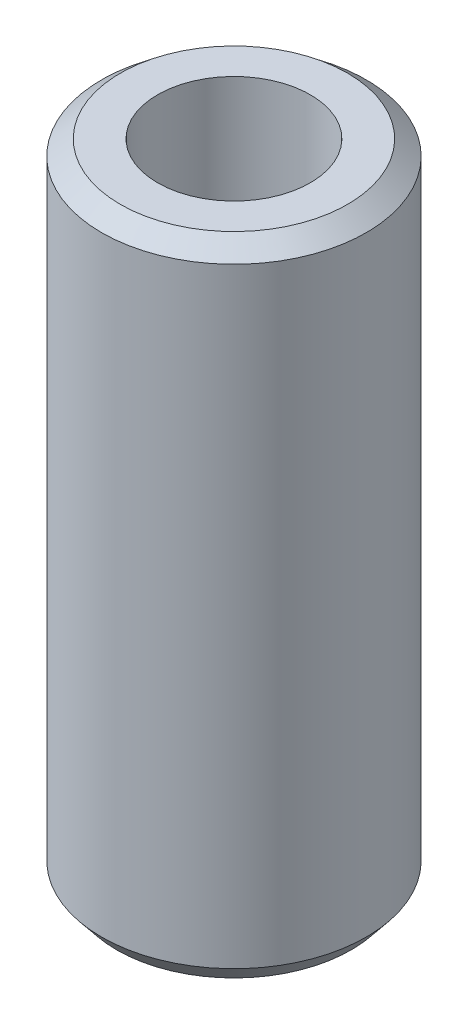
ISO-10303-21;
HEADER;
FILE_DESCRIPTION(('STEP AP214'),'2;1');
FILE_NAME('part.step','',(''),(''),'','','');
FILE_SCHEMA(('AUTOMOTIVE_DESIGN { 1 0 10303 214 1 1 1 1 }'));
ENDSEC;
DATA;
#1=APPLICATION_CONTEXT('core data for automotive mechanical design processes');
#2=APPLICATION_PROTOCOL_DEFINITION('international standard','automotive_design',2000,#1);
#3=PRODUCT_CONTEXT('',#1,'mechanical');
#4=PRODUCT('Part','Part','',(#3));
#5=PRODUCT_RELATED_PRODUCT_CATEGORY('part','',(#4));
#6=PRODUCT_DEFINITION_FORMATION('','',#4);
#7=PRODUCT_DEFINITION_CONTEXT('part definition',#1,'design');
#8=PRODUCT_DEFINITION('design','',#6,#7);
#9=PRODUCT_DEFINITION_SHAPE('','',#8);
#10=(LENGTH_UNIT() NAMED_UNIT(*) SI_UNIT(.MILLI.,.METRE.));
#11=(NAMED_UNIT(*) PLANE_ANGLE_UNIT() SI_UNIT($,.RADIAN.));
#12=(NAMED_UNIT(*) SI_UNIT($,.STERADIAN.) SOLID_ANGLE_UNIT());
#13=UNCERTAINTY_MEASURE_WITH_UNIT(LENGTH_MEASURE(1.E-05),#10,'distance_accuracy_value','');
#14=(GEOMETRIC_REPRESENTATION_CONTEXT(3) GLOBAL_UNCERTAINTY_ASSIGNED_CONTEXT((#13)) GLOBAL_UNIT_ASSIGNED_CONTEXT((#10,
#11,#12)) REPRESENTATION_CONTEXT('',''));
#15=CARTESIAN_POINT('',(0.,0.,0.));
#16=DIRECTION('',(0.,0.,1.));
#17=DIRECTION('',(1.,0.,0.));
#18=AXIS2_PLACEMENT_3D('',#15,#16,#17);
#19=CARTESIAN_POINT('',(0.,231.038125928066,0.));
#20=DIRECTION('',(0.,-1.,0.));
#21=DIRECTION('',(0.,0.,-1.));
#22=AXIS2_PLACEMENT_3D('',#19,#20,#21);
#23=CYLINDRICAL_SURFACE('',#22,47.5);
#24=CARTESIAN_POINT('',(0.,225.615658738167,0.));
#25=DIRECTION('',(0.,1.,0.));
#26=DIRECTION('',(0.,0.,1.));
#27=AXIS2_PLACEMENT_3D('',#24,#25,#26);
#28=CIRCLE('',#27,47.5);
#29=CARTESIAN_POINT('',(0.,225.615658738167,47.5));
#30=VERTEX_POINT('',#29);
#31=EDGE_CURVE('E50',#30,#30,#28,.F.);
#32=ORIENTED_EDGE('',*,*,#31,.T.);
#33=EDGE_LOOP('',(#32));
#34=FACE_BOUND('',#33,.T.);
#35=CARTESIAN_POINT('',(0.,6.71859885279838,0.));
#36=DIRECTION('',(0.,1.,0.));
#37=DIRECTION('',(0.,0.,1.));
#38=AXIS2_PLACEMENT_3D('',#35,#36,#37);
#39=CIRCLE('',#38,47.5);
#40=CARTESIAN_POINT('',(0.,6.71859885279838,47.5));
#41=VERTEX_POINT('',#40);
#42=EDGE_CURVE('E51',#41,#41,#39,.T.);
#43=ORIENTED_EDGE('',*,*,#42,.T.);
#44=EDGE_LOOP('',(#43));
#45=FACE_BOUND('',#44,.T.);
#46=ADVANCED_FACE('F39',(#34,#45),#23,.T.);
#47=CARTESIAN_POINT('',(0.,231.038125928066,0.));
#48=DIRECTION('',(0.,1.,0.));
#49=DIRECTION('',(0.,0.,1.));
#50=AXIS2_PLACEMENT_3D('',#47,#48,#49);
#51=PLANE('',#50);
#52=CARTESIAN_POINT('',(0.,231.038125928066,0.));
#53=DIRECTION('',(0.,1.,0.));
#54=DIRECTION('',(0.,0.,1.));
#55=AXIS2_PLACEMENT_3D('',#52,#53,#54);
#56=CIRCLE('',#55,40.7814011472015);
#57=CARTESIAN_POINT('',(0.,231.038125928066,40.7814011472015));
#58=VERTEX_POINT('',#57);
#59=EDGE_CURVE('E54',#58,#58,#56,.T.);
#60=ORIENTED_EDGE('',*,*,#59,.T.);
#61=EDGE_LOOP('',(#60));
#62=FACE_BOUND('',#61,.T.);
#63=CARTESIAN_POINT('',(0.,231.038125928066,0.));
#64=DIRECTION('',(0.,1.,0.));
#65=DIRECTION('',(0.,0.,1.));
#66=AXIS2_PLACEMENT_3D('',#63,#64,#65);
#67=CIRCLE('',#66,27.3940594900364);
#68=CARTESIAN_POINT('',(0.,231.038125928066,27.3940594900364));
#69=VERTEX_POINT('',#68);
#70=EDGE_CURVE('E58',#69,#69,#67,.T.);
#71=ORIENTED_EDGE('',*,*,#70,.F.);
#72=EDGE_LOOP('',(#71));
#73=FACE_BOUND('',#72,.T.);
#74=ADVANCED_FACE('F69',(#62,#73),#51,.T.);
#75=CARTESIAN_POINT('',(0.,0.,0.));
#76=DIRECTION('',(0.,1.,0.));
#77=DIRECTION('',(0.,0.,1.));
#78=AXIS2_PLACEMENT_3D('',#75,#76,#77);
#79=PLANE('',#78);
#80=CARTESIAN_POINT('',(0.,0.,0.));
#81=DIRECTION('',(0.,1.,0.));
#82=DIRECTION('',(0.,0.,1.));
#83=AXIS2_PLACEMENT_3D('',#80,#81,#82);
#84=CIRCLE('',#83,42.0775328101006);
#85=CARTESIAN_POINT('',(0.,0.,42.0775328101006));
#86=VERTEX_POINT('',#85);
#87=EDGE_CURVE('E10',#86,#86,#84,.F.);
#88=ORIENTED_EDGE('',*,*,#87,.T.);
#89=EDGE_LOOP('',(#88));
#90=FACE_BOUND('',#89,.T.);
#91=CARTESIAN_POINT('',(0.,0.,0.));
#92=DIRECTION('',(0.,1.,0.));
#93=DIRECTION('',(0.,0.,1.));
#94=AXIS2_PLACEMENT_3D('',#91,#92,#93);
#95=CIRCLE('',#94,27.3940594900364);
#96=CARTESIAN_POINT('',(0.,0.,27.3940594900364));
#97=VERTEX_POINT('',#96);
#98=EDGE_CURVE('E63',#97,#97,#95,.T.);
#99=ORIENTED_EDGE('',*,*,#98,.T.);
#100=EDGE_LOOP('',(#99));
#101=FACE_BOUND('',#100,.T.);
#102=ADVANCED_FACE('F75',(#90,#101),#79,.F.);
#103=CARTESIAN_POINT('',(0.,231.038125928066,0.));
#104=DIRECTION('',(0.,-1.,0.));
#105=DIRECTION('',(0.,0.,-1.));
#106=AXIS2_PLACEMENT_3D('',#103,#104,#105);
#107=CYLINDRICAL_SURFACE('',#106,27.3940594900364);
#108=ORIENTED_EDGE('',*,*,#70,.T.);
#109=EDGE_LOOP('',(#108));
#110=FACE_BOUND('',#109,.T.);
#111=ORIENTED_EDGE('',*,*,#98,.F.);
#112=EDGE_LOOP('',(#111));
#113=FACE_BOUND('',#112,.T.);
#114=ADVANCED_FACE('F70',(#110,#113),#107,.F.);
#115=CARTESIAN_POINT('',(0.,231.038125928066,0.));
#116=DIRECTION('',(0.,-1.,0.));
#117=DIRECTION('',(0.,0.,-1.));
#118=AXIS2_PLACEMENT_3D('',#115,#116,#117);
#119=CONICAL_SURFACE('',#118,40.7814011472015,0.891751355148273);
#120=ORIENTED_EDGE('',*,*,#31,.F.);
#121=EDGE_LOOP('',(#120));
#122=FACE_BOUND('',#121,.T.);
#123=ORIENTED_EDGE('',*,*,#59,.F.);
#124=EDGE_LOOP('',(#123));
#125=FACE_BOUND('',#124,.T.);
#126=ADVANCED_FACE('F81',(#122,#125),#119,.T.);
#127=CARTESIAN_POINT('',(0.,6.71859885279838,0.));
#128=DIRECTION('',(0.,1.,0.));
#129=DIRECTION('',(0.,0.,1.));
#130=AXIS2_PLACEMENT_3D('',#127,#128,#129);
#131=CONICAL_SURFACE('',#130,47.5,0.679044971646621);
#132=CARTESIAN_POINT('',(0.,0.,42.0775328101006));
#133=CARTESIAN_POINT('',(0.,0.0699854047166498,42.1340168433287));
#134=CARTESIAN_POINT('',(0.,0.139970809433299,42.1905008765569));
#135=CARTESIAN_POINT('',(0.,0.279941618866599,42.3034689430131));
#136=CARTESIAN_POINT('',(0.,0.349927023583248,42.3599529762412));
#137=CARTESIAN_POINT('',(0.,0.489897833016547,42.4729210426974));
#138=CARTESIAN_POINT('',(0.,0.559883237733197,42.5294050759256));
#139=CARTESIAN_POINT('',(0.,0.699854047166497,42.6423731423818));
#140=CARTESIAN_POINT('',(0.,0.769839451883147,42.6988571756099));
#141=CARTESIAN_POINT('',(0.,0.909810261316447,42.8118252420662));
#142=CARTESIAN_POINT('',(0.,0.979795666033097,42.8683092752943));
#143=CARTESIAN_POINT('',(0.,1.1197664754664,42.9812773417505));
#144=CARTESIAN_POINT('',(0.,1.18975188018304,43.0377613749786));
#145=CARTESIAN_POINT('',(0.,1.32972268961634,43.1507294414349));
#146=CARTESIAN_POINT('',(0.,1.399708094333,43.207213474663));
#147=CARTESIAN_POINT('',(0.,1.5396789037663,43.3201815411192));
#148=CARTESIAN_POINT('',(0.,1.60966430848294,43.3766655743473));
#149=CARTESIAN_POINT('',(0.,1.74963511791624,43.4896336408036));
#150=CARTESIAN_POINT('',(0.,1.81962052263289,43.5461176740317));
#151=CARTESIAN_POINT('',(0.,1.95959133206619,43.6590857404879));
#152=CARTESIAN_POINT('',(0.,2.02957673678284,43.7155697737161));
#153=CARTESIAN_POINT('',(0.,2.16954754621614,43.8285378401723));
#154=CARTESIAN_POINT('',(0.,2.23953295093279,43.8850218734004));
#155=CARTESIAN_POINT('',(0.,2.37950376036609,43.9979899398567));
#156=CARTESIAN_POINT('',(0.,2.44948916508274,44.0544739730848));
#157=CARTESIAN_POINT('',(0.,2.58945997451604,44.167442039541));
#158=CARTESIAN_POINT('',(0.,2.65944537923269,44.2239260727691));
#159=CARTESIAN_POINT('',(0.,2.79941618866599,44.3368941392254));
#160=CARTESIAN_POINT('',(0.,2.86940159338264,44.3933781724535));
#161=CARTESIAN_POINT('',(0.,3.00937240281594,44.5063462389097));
#162=CARTESIAN_POINT('',(0.,3.07935780753259,44.5628302721378));
#163=CARTESIAN_POINT('',(0.,3.21932861696589,44.6757983385941));
#164=CARTESIAN_POINT('',(0.,3.28931402168254,44.7322823718222));
#165=CARTESIAN_POINT('',(0.,3.42928483111584,44.8452504382784));
#166=CARTESIAN_POINT('',(0.,3.49927023583249,44.9017344715066));
#167=CARTESIAN_POINT('',(0.,3.63924104526579,45.0147025379628));
#168=CARTESIAN_POINT('',(0.,3.70922644998244,45.0711865711909));
#169=CARTESIAN_POINT('',(0.,3.84919725941574,45.1841546376471));
#170=CARTESIAN_POINT('',(0.,3.91918266413239,45.2406386708753));
#171=CARTESIAN_POINT('',(0.,4.05915347356569,45.3536067373315));
#172=CARTESIAN_POINT('',(0.,4.12913887828234,45.4100907705596));
#173=CARTESIAN_POINT('',(0.,4.26910968771564,45.5230588370159));
#174=CARTESIAN_POINT('',(0.,4.33909509243229,45.579542870244));
#175=CARTESIAN_POINT('',(0.,4.47906590186559,45.6925109367002));
#176=CARTESIAN_POINT('',(0.,4.54905130658224,45.7489949699283));
#177=CARTESIAN_POINT('',(0.,4.68902211601554,45.8619630363846));
#178=CARTESIAN_POINT('',(0.,4.75900752073219,45.9184470696127));
#179=CARTESIAN_POINT('',(0.,4.89897833016549,46.0314151360689));
#180=CARTESIAN_POINT('',(0.,4.96896373488214,46.087899169297));
#181=CARTESIAN_POINT('',(0.,5.10893454431544,46.2008672357533));
#182=CARTESIAN_POINT('',(0.,5.17891994903208,46.2573512689814));
#183=CARTESIAN_POINT('',(0.,5.31889075846538,46.3703193354376));
#184=CARTESIAN_POINT('',(0.,5.38887616318203,46.4268033686658));
#185=CARTESIAN_POINT('',(0.,5.52884697261533,46.539771435122));
#186=CARTESIAN_POINT('',(0.,5.59883237733198,46.5962554683501));
#187=CARTESIAN_POINT('',(0.,5.73880318676528,46.7092235348063));
#188=CARTESIAN_POINT('',(0.,5.80878859148193,46.7657075680345));
#189=CARTESIAN_POINT('',(0.,5.94875940091523,46.8786756344907));
#190=CARTESIAN_POINT('',(0.,6.01874480563188,46.9351596677188));
#191=CARTESIAN_POINT('',(0.,6.15871561506518,47.0481277341751));
#192=CARTESIAN_POINT('',(0.,6.22870101978183,47.1046117674032));
#193=CARTESIAN_POINT('',(0.,6.36867182921513,47.2175798338594));
#194=CARTESIAN_POINT('',(0.,6.43865723393178,47.2740638670875));
#195=CARTESIAN_POINT('',(0.,6.57862804336508,47.3870319335438));
#196=CARTESIAN_POINT('',(0.,6.64861344808173,47.4435159667719));
#197=CARTESIAN_POINT('',(0.,6.71859885279838,47.5));
#198=B_SPLINE_CURVE_WITH_KNOTS('',3,(#132,#133,#134,#135,#136,#137,#138,#139,#140,#141,#142,
#143,#144,#145,#146,#147,#148,#149,#150,#151,#152,#153,#154,#155,#156,#157,#158,#159,#160,#161,
#162,#163,#164,#165,#166,#167,#168,#169,#170,#171,#172,#173,#174,#175,#176,#177,#178,#179,#180,
#181,#182,#183,#184,#185,#186,#187,#188,#189,#190,#191,#192,#193,#194,#195,#196,#197),
.UNSPECIFIED.,.F.,.F.,(4,2,2,2,2,2,2,2,2,2,2,2,2,2,2,2,2,2,2,2,2,2,2,2,2,2,2,2,2,2,2,2,4),(0.,
0.26980664548453,0.539613290969064,0.809419936453599,1.07922658193813,1.34903322742266,
1.6188398729072,1.88864651839173,2.15845316387626,2.4282598093608,2.69806645484533,
2.96787310032986,3.23767974581439,3.50748639129892,3.77729303678346,4.04709968226799,
4.31690632775252,4.58671297323706,4.85651961872159,5.12632626420612,5.39613290969065,
5.66593955517518,5.93574620065972,6.20555284614425,6.47535949162878,6.74516613711332,
7.01497278259785,7.28477942808238,7.55458607356691,7.82439271905144,8.09419936453598,
8.36400601002051,8.63381265550504),.UNSPECIFIED.);
#199=EDGE_CURVE('BSEAM45',#86,#41,#198,.T.);
#200=ORIENTED_EDGE('',*,*,#87,.F.);
#201=ORIENTED_EDGE('',*,*,#42,.F.);
#202=ORIENTED_EDGE('',*,*,#199,.T.);
#203=ORIENTED_EDGE('',*,*,#199,.F.);
#204=EDGE_LOOP('',(#200,#202,#201,#203));
#205=FACE_BOUND('',#204,.T.);
#206=ADVANCED_FACE('F45',(#205),#131,.T.);
#207=CLOSED_SHELL('',(#46,#74,#102,#114,#126,#206));
#208=MANIFOLD_SOLID_BREP('B2',#207);
#209=ADVANCED_BREP_SHAPE_REPRESENTATION('',(#18,#208),#14);
#210=SHAPE_DEFINITION_REPRESENTATION(#9,#209);
ENDSEC;
END-ISO-10303-21;
